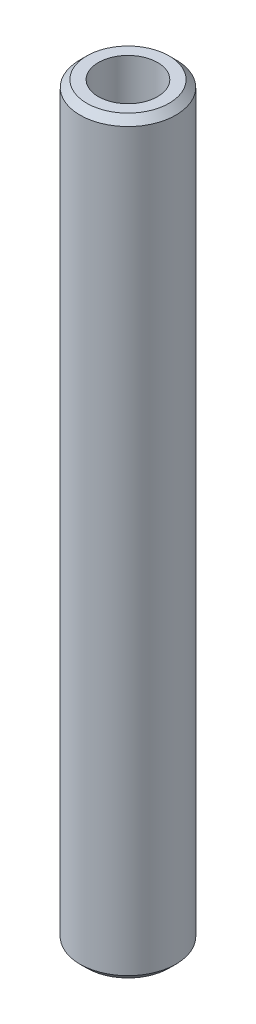
ISO-10303-21;
HEADER;
FILE_DESCRIPTION(('STEP AP214'),'2;1');
FILE_NAME('part.step','',(''),(''),'','','');
FILE_SCHEMA(('AUTOMOTIVE_DESIGN { 1 0 10303 214 1 1 1 1 }'));
ENDSEC;
DATA;
#1=APPLICATION_CONTEXT('core data for automotive mechanical design processes');
#2=APPLICATION_PROTOCOL_DEFINITION('international standard','automotive_design',2000,#1);
#3=PRODUCT_CONTEXT('',#1,'mechanical');
#4=PRODUCT('Part','Part','',(#3));
#5=PRODUCT_RELATED_PRODUCT_CATEGORY('part','',(#4));
#6=PRODUCT_DEFINITION_FORMATION('','',#4);
#7=PRODUCT_DEFINITION_CONTEXT('part definition',#1,'design');
#8=PRODUCT_DEFINITION('design','',#6,#7);
#9=PRODUCT_DEFINITION_SHAPE('','',#8);
#10=(LENGTH_UNIT() NAMED_UNIT(*) SI_UNIT(.MILLI.,.METRE.));
#11=(NAMED_UNIT(*) PLANE_ANGLE_UNIT() SI_UNIT($,.RADIAN.));
#12=(NAMED_UNIT(*) SI_UNIT($,.STERADIAN.) SOLID_ANGLE_UNIT());
#13=UNCERTAINTY_MEASURE_WITH_UNIT(LENGTH_MEASURE(1.E-05),#10,'distance_accuracy_value','');
#14=(GEOMETRIC_REPRESENTATION_CONTEXT(3) GLOBAL_UNCERTAINTY_ASSIGNED_CONTEXT((#13)) GLOBAL_UNIT_ASSIGNED_CONTEXT((#10,
#11,#12)) REPRESENTATION_CONTEXT('',''));
#15=CARTESIAN_POINT('',(0.,0.,0.));
#16=DIRECTION('',(0.,0.,1.));
#17=DIRECTION('',(1.,0.,0.));
#18=AXIS2_PLACEMENT_3D('',#15,#16,#17);
#19=CARTESIAN_POINT('',(0.,585.959490334345,0.));
#20=DIRECTION('',(0.,-1.,0.));
#21=DIRECTION('',(0.,0.,-1.));
#22=AXIS2_PLACEMENT_3D('',#19,#20,#21);
#23=CYLINDRICAL_SURFACE('',#22,37.5);
#24=CARTESIAN_POINT('',(0.,580.624090387727,0.));
#25=DIRECTION('',(0.,1.,0.));
#26=DIRECTION('',(0.,0.,1.));
#27=AXIS2_PLACEMENT_3D('',#24,#25,#26);
#28=CIRCLE('',#27,37.5);
#29=CARTESIAN_POINT('',(0.,580.624090387727,37.5));
#30=VERTEX_POINT('',#29);
#31=EDGE_CURVE('E50',#30,#30,#28,.F.);
#32=ORIENTED_EDGE('',*,*,#31,.T.);
#33=EDGE_LOOP('',(#32));
#34=FACE_BOUND('',#33,.T.);
#35=CARTESIAN_POINT('',(0.,5.33539994661747,0.));
#36=DIRECTION('',(0.,1.,0.));
#37=DIRECTION('',(0.,0.,1.));
#38=AXIS2_PLACEMENT_3D('',#35,#36,#37);
#39=CIRCLE('',#38,37.5);
#40=CARTESIAN_POINT('',(0.,5.33539994661747,37.5));
#41=VERTEX_POINT('',#40);
#42=EDGE_CURVE('E51',#41,#41,#39,.T.);
#43=ORIENTED_EDGE('',*,*,#42,.T.);
#44=EDGE_LOOP('',(#43));
#45=FACE_BOUND('',#44,.T.);
#46=ADVANCED_FACE('F39',(#34,#45),#23,.T.);
#47=CARTESIAN_POINT('',(0.,585.959490334345,0.));
#48=DIRECTION('',(0.,1.,0.));
#49=DIRECTION('',(0.,0.,1.));
#50=AXIS2_PLACEMENT_3D('',#47,#48,#49);
#51=PLANE('',#50);
#52=CARTESIAN_POINT('',(0.,585.959490334345,0.));
#53=DIRECTION('',(0.,1.,0.));
#54=DIRECTION('',(0.,0.,1.));
#55=AXIS2_PLACEMENT_3D('',#52,#53,#54);
#56=CIRCLE('',#55,32.1646000533824);
#57=CARTESIAN_POINT('',(0.,585.959490334345,32.1646000533824));
#58=VERTEX_POINT('',#57);
#59=EDGE_CURVE('E54',#58,#58,#56,.T.);
#60=ORIENTED_EDGE('',*,*,#59,.T.);
#61=EDGE_LOOP('',(#60));
#62=FACE_BOUND('',#61,.T.);
#63=CARTESIAN_POINT('',(0.,585.959490334345,0.));
#64=DIRECTION('',(0.,1.,0.));
#65=DIRECTION('',(0.,0.,1.));
#66=AXIS2_PLACEMENT_3D('',#63,#64,#65);
#67=CIRCLE('',#66,23.1603493601853);
#68=CARTESIAN_POINT('',(0.,585.959490334345,23.1603493601853));
#69=VERTEX_POINT('',#68);
#70=EDGE_CURVE('E58',#69,#69,#67,.T.);
#71=ORIENTED_EDGE('',*,*,#70,.F.);
#72=EDGE_LOOP('',(#71));
#73=FACE_BOUND('',#72,.T.);
#74=ADVANCED_FACE('F69',(#62,#73),#51,.T.);
#75=CARTESIAN_POINT('',(0.,0.,0.));
#76=DIRECTION('',(0.,1.,0.));
#77=DIRECTION('',(0.,0.,1.));
#78=AXIS2_PLACEMENT_3D('',#75,#76,#77);
#79=PLANE('',#78);
#80=CARTESIAN_POINT('',(0.,0.,0.));
#81=DIRECTION('',(0.,1.,0.));
#82=DIRECTION('',(0.,0.,1.));
#83=AXIS2_PLACEMENT_3D('',#80,#81,#82);
#84=CIRCLE('',#83,32.1646000533825);
#85=CARTESIAN_POINT('',(0.,0.,32.1646000533825));
#86=VERTEX_POINT('',#85);
#87=EDGE_CURVE('E10',#86,#86,#84,.F.);
#88=ORIENTED_EDGE('',*,*,#87,.T.);
#89=EDGE_LOOP('',(#88));
#90=FACE_BOUND('',#89,.T.);
#91=CARTESIAN_POINT('',(0.,0.,0.));
#92=DIRECTION('',(0.,1.,0.));
#93=DIRECTION('',(0.,0.,1.));
#94=AXIS2_PLACEMENT_3D('',#91,#92,#93);
#95=CIRCLE('',#94,23.1603493601853);
#96=CARTESIAN_POINT('',(0.,0.,23.1603493601853));
#97=VERTEX_POINT('',#96);
#98=EDGE_CURVE('E63',#97,#97,#95,.T.);
#99=ORIENTED_EDGE('',*,*,#98,.T.);
#100=EDGE_LOOP('',(#99));
#101=FACE_BOUND('',#100,.T.);
#102=ADVANCED_FACE('F75',(#90,#101),#79,.F.);
#103=CARTESIAN_POINT('',(0.,585.959490334345,0.));
#104=DIRECTION('',(0.,-1.,0.));
#105=DIRECTION('',(0.,0.,-1.));
#106=AXIS2_PLACEMENT_3D('',#103,#104,#105);
#107=CYLINDRICAL_SURFACE('',#106,23.1603493601853);
#108=ORIENTED_EDGE('',*,*,#70,.T.);
#109=EDGE_LOOP('',(#108));
#110=FACE_BOUND('',#109,.T.);
#111=ORIENTED_EDGE('',*,*,#98,.F.);
#112=EDGE_LOOP('',(#111));
#113=FACE_BOUND('',#112,.T.);
#114=ADVANCED_FACE('F70',(#110,#113),#107,.F.);
#115=CARTESIAN_POINT('',(0.,585.959490334345,0.));
#116=DIRECTION('',(0.,-1.,0.));
#117=DIRECTION('',(0.,0.,-1.));
#118=AXIS2_PLACEMENT_3D('',#115,#116,#117);
#119=CONICAL_SURFACE('',#118,32.1646000533824,0.785398163397441);
#120=ORIENTED_EDGE('',*,*,#31,.F.);
#121=EDGE_LOOP('',(#120));
#122=FACE_BOUND('',#121,.T.);
#123=ORIENTED_EDGE('',*,*,#59,.F.);
#124=EDGE_LOOP('',(#123));
#125=FACE_BOUND('',#124,.T.);
#126=ADVANCED_FACE('F81',(#122,#125),#119,.T.);
#127=CARTESIAN_POINT('',(0.,5.33539994661747,0.));
#128=DIRECTION('',(0.,1.,0.));
#129=DIRECTION('',(0.,0.,1.));
#130=AXIS2_PLACEMENT_3D('',#127,#128,#129);
#131=CONICAL_SURFACE('',#130,37.5,0.785398163397456);
#132=ORIENTED_EDGE('',*,*,#87,.F.);
#133=EDGE_LOOP('',(#132));
#134=FACE_BOUND('',#133,.T.);
#135=ORIENTED_EDGE('',*,*,#42,.F.);
#136=EDGE_LOOP('',(#135));
#137=FACE_BOUND('',#136,.T.);
#138=ADVANCED_FACE('F45',(#134,#137),#131,.T.);
#139=CLOSED_SHELL('',(#46,#74,#102,#114,#126,#138));
#140=MANIFOLD_SOLID_BREP('B2',#139);
#141=ADVANCED_BREP_SHAPE_REPRESENTATION('',(#18,#140),#14);
#142=SHAPE_DEFINITION_REPRESENTATION(#9,#141);
ENDSEC;
END-ISO-10303-21;
